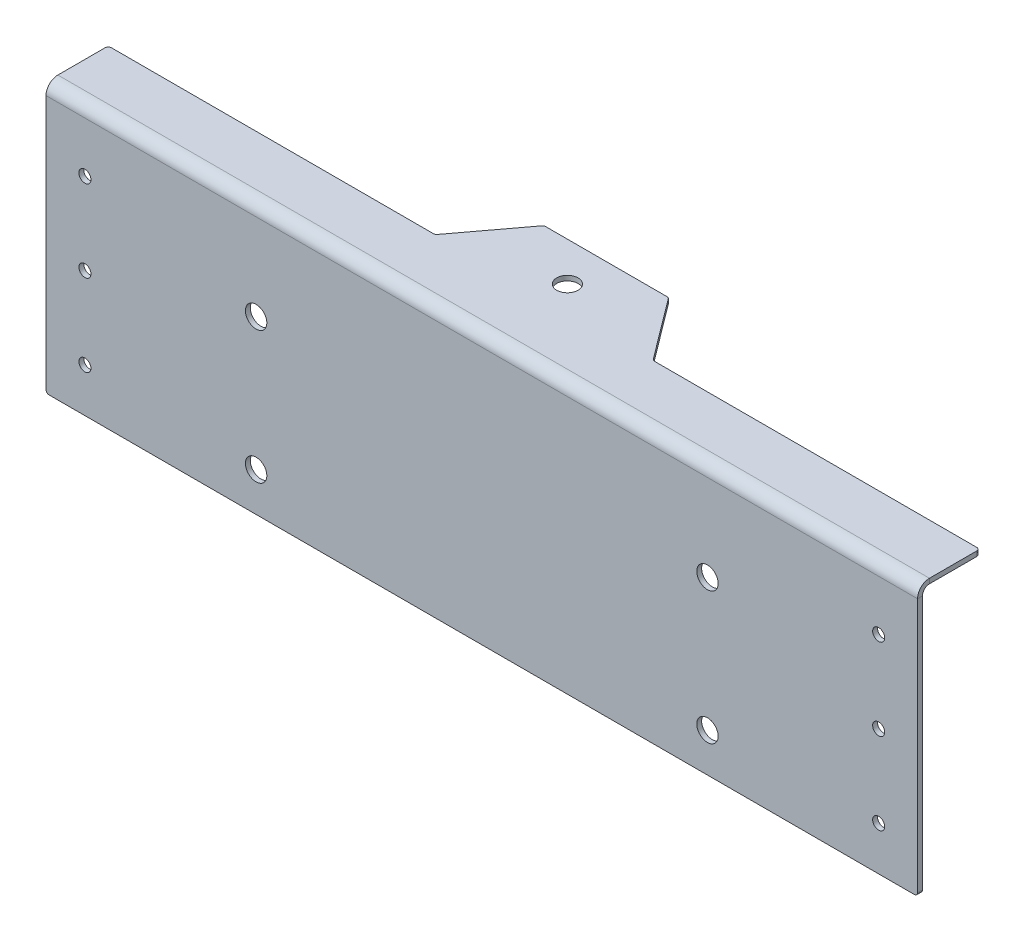
ISO-10303-21;
HEADER;
FILE_DESCRIPTION(('STEP AP214'),'2;1');
FILE_NAME('part.step','',(''),(''),'','','');
FILE_SCHEMA(('AUTOMOTIVE_DESIGN { 1 0 10303 214 1 1 1 1 }'));
ENDSEC;
DATA;
#1=APPLICATION_CONTEXT('core data for automotive mechanical design processes');
#2=APPLICATION_PROTOCOL_DEFINITION('international standard','automotive_design',2000,#1);
#3=PRODUCT_CONTEXT('',#1,'mechanical');
#4=PRODUCT('Part','Part','',(#3));
#5=PRODUCT_RELATED_PRODUCT_CATEGORY('part','',(#4));
#6=PRODUCT_DEFINITION_FORMATION('','',#4);
#7=PRODUCT_DEFINITION_CONTEXT('part definition',#1,'design');
#8=PRODUCT_DEFINITION('design','',#6,#7);
#9=PRODUCT_DEFINITION_SHAPE('','',#8);
#10=(LENGTH_UNIT() NAMED_UNIT(*) SI_UNIT(.MILLI.,.METRE.));
#11=(NAMED_UNIT(*) PLANE_ANGLE_UNIT() SI_UNIT($,.RADIAN.));
#12=(NAMED_UNIT(*) SI_UNIT($,.STERADIAN.) SOLID_ANGLE_UNIT());
#13=UNCERTAINTY_MEASURE_WITH_UNIT(LENGTH_MEASURE(1.E-05),#10,'distance_accuracy_value','');
#14=(GEOMETRIC_REPRESENTATION_CONTEXT(3) GLOBAL_UNCERTAINTY_ASSIGNED_CONTEXT((#13)) GLOBAL_UNIT_ASSIGNED_CONTEXT((#10,
#11,#12)) REPRESENTATION_CONTEXT('',''));
#15=CARTESIAN_POINT('',(0.,0.,0.));
#16=DIRECTION('',(0.,0.,1.));
#17=DIRECTION('',(1.,0.,0.));
#18=AXIS2_PLACEMENT_3D('',#15,#16,#17);
#19=CARTESIAN_POINT('',(0.,0.,-1.9939));
#20=DIRECTION('',(-1.,0.,0.));
#21=DIRECTION('',(0.,0.,1.));
#22=AXIS2_PLACEMENT_3D('',#19,#20,#21);
#23=PLANE('',#22);
#24=DIRECTION('',(0.,-1.,0.));
#25=VECTOR('',#24,1.);
#26=CARTESIAN_POINT('',(0.,0.,-1.9939));
#27=LINE('',#26,#25);
#28=CARTESIAN_POINT('',(0.,105.156,-1.99389999999998));
#29=VERTEX_POINT('',#28);
#30=CARTESIAN_POINT('',(0.,1.27,-1.9939));
#31=VERTEX_POINT('',#30);
#32=EDGE_CURVE('E334',#29,#31,#27,.T.);
#33=ORIENTED_EDGE('',*,*,#32,.T.);
#34=DIRECTION('',(0.,0.,1.));
#35=VECTOR('',#34,1.);
#36=CARTESIAN_POINT('',(0.,1.27,-1.9939));
#37=LINE('',#36,#35);
#38=CARTESIAN_POINT('',(0.,1.27,0.));
#39=VERTEX_POINT('',#38);
#40=EDGE_CURVE('E419',#31,#39,#37,.T.);
#41=ORIENTED_EDGE('',*,*,#40,.T.);
#42=DIRECTION('',(0.,-1.,0.));
#43=VECTOR('',#42,1.);
#44=CARTESIAN_POINT('',(0.,0.,0.));
#45=LINE('',#44,#43);
#46=CARTESIAN_POINT('',(0.,105.156,0.));
#47=VERTEX_POINT('',#46);
#48=EDGE_CURVE('E329',#47,#39,#45,.T.);
#49=ORIENTED_EDGE('',*,*,#48,.F.);
#50=DIRECTION('',(0.,0.,1.));
#51=VECTOR('',#50,1.);
#52=CARTESIAN_POINT('',(0.,105.156,-1.9939));
#53=LINE('',#52,#51);
#54=EDGE_CURVE('E352',#29,#47,#53,.T.);
#55=ORIENTED_EDGE('',*,*,#54,.F.);
#56=EDGE_LOOP('',(#33,#41,#49,#55));
#57=FACE_BOUND('',#56,.T.);
#58=ADVANCED_FACE('F120',(#57),#23,.T.);
#59=CARTESIAN_POINT('',(355.6,0.,-1.9939));
#60=DIRECTION('',(1.,0.,0.));
#61=DIRECTION('',(0.,0.,-1.));
#62=AXIS2_PLACEMENT_3D('',#59,#60,#61);
#63=PLANE('',#62);
#64=DIRECTION('',(0.,1.,0.));
#65=VECTOR('',#64,1.);
#66=CARTESIAN_POINT('',(355.6,0.,0.));
#67=LINE('',#66,#65);
#68=CARTESIAN_POINT('',(355.6,1.27,0.));
#69=VERTEX_POINT('',#68);
#70=CARTESIAN_POINT('',(355.6,105.156,0.));
#71=VERTEX_POINT('',#70);
#72=EDGE_CURVE('E349',#69,#71,#67,.T.);
#73=ORIENTED_EDGE('',*,*,#72,.F.);
#74=DIRECTION('',(0.,0.,1.));
#75=VECTOR('',#74,1.);
#76=CARTESIAN_POINT('',(355.6,1.27,-1.9939));
#77=LINE('',#76,#75);
#78=CARTESIAN_POINT('',(355.6,1.27,-1.9939));
#79=VERTEX_POINT('',#78);
#80=EDGE_CURVE('E143',#69,#79,#77,.F.);
#81=ORIENTED_EDGE('',*,*,#80,.T.);
#82=DIRECTION('',(0.,1.,0.));
#83=VECTOR('',#82,1.);
#84=CARTESIAN_POINT('',(355.6,0.,-1.9939));
#85=LINE('',#84,#83);
#86=CARTESIAN_POINT('',(355.6,105.156,-1.99389999999998));
#87=VERTEX_POINT('',#86);
#88=EDGE_CURVE('E339',#79,#87,#85,.T.);
#89=ORIENTED_EDGE('',*,*,#88,.T.);
#90=DIRECTION('',(0.,0.,1.));
#91=VECTOR('',#90,1.);
#92=CARTESIAN_POINT('',(355.6,105.156,-1.9939));
#93=LINE('',#92,#91);
#94=EDGE_CURVE('E343',#87,#71,#93,.T.);
#95=ORIENTED_EDGE('',*,*,#94,.T.);
#96=EDGE_LOOP('',(#73,#81,#89,#95));
#97=FACE_BOUND('',#96,.T.);
#98=ADVANCED_FACE('F552',(#97),#63,.T.);
#99=CARTESIAN_POINT('',(0.,0.,-1.9939));
#100=DIRECTION('',(0.,-1.,0.));
#101=DIRECTION('',(0.,0.,-1.));
#102=AXIS2_PLACEMENT_3D('',#99,#100,#101);
#103=PLANE('',#102);
#104=DIRECTION('',(1.,0.,0.));
#105=VECTOR('',#104,1.);
#106=CARTESIAN_POINT('',(0.,0.,-1.9939));
#107=LINE('',#106,#105);
#108=CARTESIAN_POINT('',(1.27,0.,-1.9939));
#109=VERTEX_POINT('',#108);
#110=CARTESIAN_POINT('',(354.33,0.,-1.9939));
#111=VERTEX_POINT('',#110);
#112=EDGE_CURVE('E336',#109,#111,#107,.T.);
#113=ORIENTED_EDGE('',*,*,#112,.T.);
#114=DIRECTION('',(0.,0.,1.));
#115=VECTOR('',#114,1.);
#116=CARTESIAN_POINT('',(354.33,0.,-1.9939));
#117=LINE('',#116,#115);
#118=CARTESIAN_POINT('',(354.33,0.,0.));
#119=VERTEX_POINT('',#118);
#120=EDGE_CURVE('E408',#111,#119,#117,.T.);
#121=ORIENTED_EDGE('',*,*,#120,.T.);
#122=DIRECTION('',(1.,0.,0.));
#123=VECTOR('',#122,1.);
#124=CARTESIAN_POINT('',(0.,0.,0.));
#125=LINE('',#124,#123);
#126=CARTESIAN_POINT('',(1.27,0.,0.));
#127=VERTEX_POINT('',#126);
#128=EDGE_CURVE('E346',#127,#119,#125,.T.);
#129=ORIENTED_EDGE('',*,*,#128,.F.);
#130=DIRECTION('',(0.,0.,1.));
#131=VECTOR('',#130,1.);
#132=CARTESIAN_POINT('',(1.27,0.,-1.9939));
#133=LINE('',#132,#131);
#134=EDGE_CURVE('E406',#127,#109,#133,.F.);
#135=ORIENTED_EDGE('',*,*,#134,.T.);
#136=EDGE_LOOP('',(#113,#121,#129,#135));
#137=FACE_BOUND('',#136,.T.);
#138=ADVANCED_FACE('F545',(#137),#103,.T.);
#139=CARTESIAN_POINT('',(0.,0.,-1.9939));
#140=DIRECTION('',(0.,0.,-1.));
#141=DIRECTION('',(-1.,0.,0.));
#142=AXIS2_PLACEMENT_3D('',#139,#140,#141);
#143=PLANE('',#142);
#144=CARTESIAN_POINT('',(85.725,69.86397,-1.9939));
#145=DIRECTION('',(0.,0.,-1.));
#146=DIRECTION('',(-1.,0.,0.));
#147=AXIS2_PLACEMENT_3D('',#144,#145,#146);
#148=CIRCLE('',#147,4.36879999999999);
#149=CARTESIAN_POINT('',(81.3562,69.86397,-1.9939));
#150=VERTEX_POINT('',#149);
#151=EDGE_CURVE('E509',#150,#150,#148,.T.);
#152=ORIENTED_EDGE('',*,*,#151,.F.);
#153=EDGE_LOOP('',(#152));
#154=FACE_BOUND('',#153,.T.);
#155=CARTESIAN_POINT('',(85.725,15.88897,-1.9939));
#156=DIRECTION('',(0.,0.,-1.));
#157=DIRECTION('',(-1.,0.,0.));
#158=AXIS2_PLACEMENT_3D('',#155,#156,#157);
#159=CIRCLE('',#158,4.36879999999999);
#160=CARTESIAN_POINT('',(81.3562,15.88897,-1.9939));
#161=VERTEX_POINT('',#160);
#162=EDGE_CURVE('E503',#161,#161,#159,.T.);
#163=ORIENTED_EDGE('',*,*,#162,.F.);
#164=EDGE_LOOP('',(#163));
#165=FACE_BOUND('',#164,.T.);
#166=CARTESIAN_POINT('',(269.875,15.88897,-1.9939));
#167=DIRECTION('',(0.,0.,-1.));
#168=DIRECTION('',(-1.,0.,0.));
#169=AXIS2_PLACEMENT_3D('',#166,#167,#168);
#170=CIRCLE('',#169,4.36880000000001);
#171=CARTESIAN_POINT('',(265.5062,15.88897,-1.9939));
#172=VERTEX_POINT('',#171);
#173=EDGE_CURVE('E497',#172,#172,#170,.T.);
#174=ORIENTED_EDGE('',*,*,#173,.F.);
#175=EDGE_LOOP('',(#174));
#176=FACE_BOUND('',#175,.T.);
#177=CARTESIAN_POINT('',(269.875,69.86397,-1.9939));
#178=DIRECTION('',(0.,0.,-1.));
#179=DIRECTION('',(-1.,0.,0.));
#180=AXIS2_PLACEMENT_3D('',#177,#178,#179);
#181=CIRCLE('',#180,4.36880000000001);
#182=CARTESIAN_POINT('',(265.5062,69.86397,-1.9939));
#183=VERTEX_POINT('',#182);
#184=EDGE_CURVE('E491',#183,#183,#181,.T.);
#185=ORIENTED_EDGE('',*,*,#184,.F.);
#186=EDGE_LOOP('',(#185));
#187=FACE_BOUND('',#186,.T.);
#188=CARTESIAN_POINT('',(15.875,84.59597,-1.9939));
#189=DIRECTION('',(0.,0.,-1.));
#190=DIRECTION('',(-1.,0.,0.));
#191=AXIS2_PLACEMENT_3D('',#188,#189,#190);
#192=CIRCLE('',#191,2.45744999999999);
#193=CARTESIAN_POINT('',(13.41755,84.59597,-1.9939));
#194=VERTEX_POINT('',#193);
#195=EDGE_CURVE('E484',#194,#194,#192,.T.);
#196=ORIENTED_EDGE('',*,*,#195,.F.);
#197=EDGE_LOOP('',(#196));
#198=FACE_BOUND('',#197,.T.);
#199=CARTESIAN_POINT('',(15.875,17.92097,-1.9939));
#200=DIRECTION('',(0.,0.,-1.));
#201=DIRECTION('',(-1.,0.,0.));
#202=AXIS2_PLACEMENT_3D('',#199,#200,#201);
#203=CIRCLE('',#202,2.45744999999999);
#204=CARTESIAN_POINT('',(13.41755,17.92097,-1.9939));
#205=VERTEX_POINT('',#204);
#206=EDGE_CURVE('E478',#205,#205,#203,.T.);
#207=ORIENTED_EDGE('',*,*,#206,.F.);
#208=EDGE_LOOP('',(#207));
#209=FACE_BOUND('',#208,.T.);
#210=CARTESIAN_POINT('',(339.725,17.92097,-1.9939));
#211=DIRECTION('',(0.,0.,-1.));
#212=DIRECTION('',(-1.,0.,0.));
#213=AXIS2_PLACEMENT_3D('',#210,#211,#212);
#214=CIRCLE('',#213,2.45744999999997);
#215=CARTESIAN_POINT('',(337.26755,17.92097,-1.9939));
#216=VERTEX_POINT('',#215);
#217=EDGE_CURVE('E472',#216,#216,#214,.T.);
#218=ORIENTED_EDGE('',*,*,#217,.F.);
#219=EDGE_LOOP('',(#218));
#220=FACE_BOUND('',#219,.T.);
#221=CARTESIAN_POINT('',(339.725,84.59597,-1.9939));
#222=DIRECTION('',(0.,0.,-1.));
#223=DIRECTION('',(-1.,0.,0.));
#224=AXIS2_PLACEMENT_3D('',#221,#222,#223);
#225=CIRCLE('',#224,2.45744999999997);
#226=CARTESIAN_POINT('',(337.26755,84.59597,-1.9939));
#227=VERTEX_POINT('',#226);
#228=EDGE_CURVE('E466',#227,#227,#225,.T.);
#229=ORIENTED_EDGE('',*,*,#228,.F.);
#230=EDGE_LOOP('',(#229));
#231=FACE_BOUND('',#230,.T.);
#232=CARTESIAN_POINT('',(15.875,51.25847,-1.9939));
#233=DIRECTION('',(0.,0.,-1.));
#234=DIRECTION('',(-1.,0.,0.));
#235=AXIS2_PLACEMENT_3D('',#232,#233,#234);
#236=CIRCLE('',#235,2.45744999999999);
#237=CARTESIAN_POINT('',(13.41755,51.25847,-1.9939));
#238=VERTEX_POINT('',#237);
#239=EDGE_CURVE('E460',#238,#238,#236,.T.);
#240=ORIENTED_EDGE('',*,*,#239,.F.);
#241=EDGE_LOOP('',(#240));
#242=FACE_BOUND('',#241,.T.);
#243=CARTESIAN_POINT('',(339.725,51.25847,-1.9939));
#244=DIRECTION('',(0.,0.,-1.));
#245=DIRECTION('',(-1.,0.,0.));
#246=AXIS2_PLACEMENT_3D('',#243,#244,#245);
#247=CIRCLE('',#246,2.45744999999997);
#248=CARTESIAN_POINT('',(337.26755,51.25847,-1.9939));
#249=VERTEX_POINT('',#248);
#250=EDGE_CURVE('E328',#249,#249,#247,.T.);
#251=ORIENTED_EDGE('',*,*,#250,.F.);
#252=EDGE_LOOP('',(#251));
#253=FACE_BOUND('',#252,.T.);
#254=ORIENTED_EDGE('',*,*,#88,.F.);
#255=CARTESIAN_POINT('',(354.33,1.27,-1.9939));
#256=DIRECTION('',(0.,0.,-1.));
#257=DIRECTION('',(-1.,0.,0.));
#258=AXIS2_PLACEMENT_3D('',#255,#256,#257);
#259=CIRCLE('',#258,1.27);
#260=EDGE_CURVE('E417',#79,#111,#259,.T.);
#261=ORIENTED_EDGE('',*,*,#260,.T.);
#262=ORIENTED_EDGE('',*,*,#112,.F.);
#263=CARTESIAN_POINT('',(1.27,1.27,-1.9939));
#264=DIRECTION('',(0.,0.,-1.));
#265=DIRECTION('',(-1.,0.,0.));
#266=AXIS2_PLACEMENT_3D('',#263,#264,#265);
#267=CIRCLE('',#266,1.27);
#268=EDGE_CURVE('E135',#109,#31,#267,.T.);
#269=ORIENTED_EDGE('',*,*,#268,.T.);
#270=ORIENTED_EDGE('',*,*,#32,.F.);
#271=DIRECTION('',(-1.,0.,0.));
#272=VECTOR('',#271,1.);
#273=CARTESIAN_POINT('',(0.,105.156,-1.9939));
#274=LINE('',#273,#272);
#275=EDGE_CURVE('E341',#87,#29,#274,.T.);
#276=ORIENTED_EDGE('',*,*,#275,.F.);
#277=EDGE_LOOP('',(#254,#261,#262,#269,#270,#276));
#278=FACE_BOUND('',#277,.T.);
#279=ADVANCED_FACE('F522',(#154,#165,#176,#187,#198,#209,#220,#231,#242,#253,#278),#143,.T.);
#280=CARTESIAN_POINT('',(0.,0.,0.));
#281=DIRECTION('',(0.,0.,-1.));
#282=DIRECTION('',(-1.,0.,0.));
#283=AXIS2_PLACEMENT_3D('',#280,#281,#282);
#284=PLANE('',#283);
#285=CARTESIAN_POINT('',(85.725,69.86397,0.));
#286=DIRECTION('',(0.,0.,1.));
#287=DIRECTION('',(1.,0.,0.));
#288=AXIS2_PLACEMENT_3D('',#285,#286,#287);
#289=CIRCLE('',#288,4.36879999999999);
#290=CARTESIAN_POINT('',(90.0938,69.86397,0.));
#291=VERTEX_POINT('',#290);
#292=EDGE_CURVE('E512',#291,#291,#289,.T.);
#293=ORIENTED_EDGE('',*,*,#292,.F.);
#294=EDGE_LOOP('',(#293));
#295=FACE_BOUND('',#294,.T.);
#296=CARTESIAN_POINT('',(85.725,15.88897,0.));
#297=DIRECTION('',(0.,0.,1.));
#298=DIRECTION('',(1.,0.,0.));
#299=AXIS2_PLACEMENT_3D('',#296,#297,#298);
#300=CIRCLE('',#299,4.36879999999999);
#301=CARTESIAN_POINT('',(90.0938,15.88897,0.));
#302=VERTEX_POINT('',#301);
#303=EDGE_CURVE('E506',#302,#302,#300,.T.);
#304=ORIENTED_EDGE('',*,*,#303,.F.);
#305=EDGE_LOOP('',(#304));
#306=FACE_BOUND('',#305,.T.);
#307=CARTESIAN_POINT('',(269.875,15.88897,0.));
#308=DIRECTION('',(0.,0.,1.));
#309=DIRECTION('',(1.,0.,0.));
#310=AXIS2_PLACEMENT_3D('',#307,#308,#309);
#311=CIRCLE('',#310,4.36880000000001);
#312=CARTESIAN_POINT('',(274.2438,15.88897,0.));
#313=VERTEX_POINT('',#312);
#314=EDGE_CURVE('E500',#313,#313,#311,.T.);
#315=ORIENTED_EDGE('',*,*,#314,.F.);
#316=EDGE_LOOP('',(#315));
#317=FACE_BOUND('',#316,.T.);
#318=CARTESIAN_POINT('',(269.875,69.86397,0.));
#319=DIRECTION('',(0.,0.,1.));
#320=DIRECTION('',(1.,0.,0.));
#321=AXIS2_PLACEMENT_3D('',#318,#319,#320);
#322=CIRCLE('',#321,4.36880000000001);
#323=CARTESIAN_POINT('',(274.2438,69.86397,0.));
#324=VERTEX_POINT('',#323);
#325=EDGE_CURVE('E494',#324,#324,#322,.T.);
#326=ORIENTED_EDGE('',*,*,#325,.F.);
#327=EDGE_LOOP('',(#326));
#328=FACE_BOUND('',#327,.T.);
#329=CARTESIAN_POINT('',(15.875,84.59597,0.));
#330=DIRECTION('',(0.,0.,1.));
#331=DIRECTION('',(1.,0.,0.));
#332=AXIS2_PLACEMENT_3D('',#329,#330,#331);
#333=CIRCLE('',#332,2.45744999999999);
#334=CARTESIAN_POINT('',(18.33245,84.59597,0.));
#335=VERTEX_POINT('',#334);
#336=EDGE_CURVE('E360',#335,#335,#333,.T.);
#337=ORIENTED_EDGE('',*,*,#336,.F.);
#338=EDGE_LOOP('',(#337));
#339=FACE_BOUND('',#338,.T.);
#340=CARTESIAN_POINT('',(15.875,17.92097,0.));
#341=DIRECTION('',(0.,0.,1.));
#342=DIRECTION('',(1.,0.,0.));
#343=AXIS2_PLACEMENT_3D('',#340,#341,#342);
#344=CIRCLE('',#343,2.45744999999999);
#345=CARTESIAN_POINT('',(18.33245,17.92097,0.));
#346=VERTEX_POINT('',#345);
#347=EDGE_CURVE('E481',#346,#346,#344,.T.);
#348=ORIENTED_EDGE('',*,*,#347,.F.);
#349=EDGE_LOOP('',(#348));
#350=FACE_BOUND('',#349,.T.);
#351=CARTESIAN_POINT('',(339.725,17.92097,0.));
#352=DIRECTION('',(0.,0.,1.));
#353=DIRECTION('',(1.,0.,0.));
#354=AXIS2_PLACEMENT_3D('',#351,#352,#353);
#355=CIRCLE('',#354,2.45744999999997);
#356=CARTESIAN_POINT('',(342.18245,17.92097,0.));
#357=VERTEX_POINT('',#356);
#358=EDGE_CURVE('E475',#357,#357,#355,.T.);
#359=ORIENTED_EDGE('',*,*,#358,.F.);
#360=EDGE_LOOP('',(#359));
#361=FACE_BOUND('',#360,.T.);
#362=CARTESIAN_POINT('',(339.725,84.59597,0.));
#363=DIRECTION('',(0.,0.,1.));
#364=DIRECTION('',(1.,0.,0.));
#365=AXIS2_PLACEMENT_3D('',#362,#363,#364);
#366=CIRCLE('',#365,2.45744999999997);
#367=CARTESIAN_POINT('',(342.18245,84.59597,0.));
#368=VERTEX_POINT('',#367);
#369=EDGE_CURVE('E469',#368,#368,#366,.T.);
#370=ORIENTED_EDGE('',*,*,#369,.F.);
#371=EDGE_LOOP('',(#370));
#372=FACE_BOUND('',#371,.T.);
#373=CARTESIAN_POINT('',(15.875,51.25847,0.));
#374=DIRECTION('',(0.,0.,1.));
#375=DIRECTION('',(1.,0.,0.));
#376=AXIS2_PLACEMENT_3D('',#373,#374,#375);
#377=CIRCLE('',#376,2.45744999999999);
#378=CARTESIAN_POINT('',(18.33245,51.25847,0.));
#379=VERTEX_POINT('',#378);
#380=EDGE_CURVE('E463',#379,#379,#377,.T.);
#381=ORIENTED_EDGE('',*,*,#380,.F.);
#382=EDGE_LOOP('',(#381));
#383=FACE_BOUND('',#382,.T.);
#384=CARTESIAN_POINT('',(339.725,51.25847,0.));
#385=DIRECTION('',(0.,0.,1.));
#386=DIRECTION('',(1.,0.,0.));
#387=AXIS2_PLACEMENT_3D('',#384,#385,#386);
#388=CIRCLE('',#387,2.45744999999997);
#389=CARTESIAN_POINT('',(342.18245,51.25847,0.));
#390=VERTEX_POINT('',#389);
#391=EDGE_CURVE('E457',#390,#390,#388,.T.);
#392=ORIENTED_EDGE('',*,*,#391,.F.);
#393=EDGE_LOOP('',(#392));
#394=FACE_BOUND('',#393,.T.);
#395=ORIENTED_EDGE('',*,*,#128,.T.);
#396=CARTESIAN_POINT('',(354.33,1.27,0.));
#397=DIRECTION('',(0.,0.,-1.));
#398=DIRECTION('',(-1.,0.,0.));
#399=AXIS2_PLACEMENT_3D('',#396,#397,#398);
#400=CIRCLE('',#399,1.27);
#401=EDGE_CURVE('E413',#119,#69,#400,.F.);
#402=ORIENTED_EDGE('',*,*,#401,.T.);
#403=ORIENTED_EDGE('',*,*,#72,.T.);
#404=DIRECTION('',(-1.,0.,0.));
#405=VECTOR('',#404,1.);
#406=CARTESIAN_POINT('',(0.,105.156,0.));
#407=LINE('',#406,#405);
#408=EDGE_CURVE('E267',#71,#47,#407,.T.);
#409=ORIENTED_EDGE('',*,*,#408,.T.);
#410=ORIENTED_EDGE('',*,*,#48,.T.);
#411=CARTESIAN_POINT('',(1.27,1.27,0.));
#412=DIRECTION('',(0.,0.,-1.));
#413=DIRECTION('',(-1.,0.,0.));
#414=AXIS2_PLACEMENT_3D('',#411,#412,#413);
#415=CIRCLE('',#414,1.27);
#416=EDGE_CURVE('E411',#39,#127,#415,.F.);
#417=ORIENTED_EDGE('',*,*,#416,.T.);
#418=EDGE_LOOP('',(#395,#402,#403,#409,#410,#417));
#419=FACE_BOUND('',#418,.T.);
#420=ADVANCED_FACE('F518',(#295,#306,#317,#328,#339,#350,#361,#372,#383,#394,#419),#284,.F.);
#421=CARTESIAN_POINT('',(0.,105.156,-4.83996999999999));
#422=DIRECTION('',(-1.,0.,0.));
#423=DIRECTION('',(0.,0.,1.));
#424=AXIS2_PLACEMENT_3D('',#421,#422,#423);
#425=PLANE('',#424);
#426=DIRECTION('',(0.,-1.,0.));
#427=VECTOR('',#426,1.);
#428=CARTESIAN_POINT('',(0.,109.99597,-4.83996999999998));
#429=LINE('',#428,#427);
#430=CARTESIAN_POINT('',(0.,108.00207,-4.83996999999998));
#431=VERTEX_POINT('',#430);
#432=CARTESIAN_POINT('',(0.,109.99597,-4.83996999999997));
#433=VERTEX_POINT('',#432);
#434=EDGE_CURVE('E325',#431,#433,#429,.F.);
#435=ORIENTED_EDGE('',*,*,#434,.F.);
#436=CARTESIAN_POINT('',(0.,105.156,-4.83996999999999));
#437=DIRECTION('',(1.,0.,0.));
#438=DIRECTION('',(0.,0.,-1.));
#439=AXIS2_PLACEMENT_3D('',#436,#437,#438);
#440=CIRCLE('',#439,2.84607000000001);
#441=EDGE_CURVE('E272',#29,#431,#440,.F.);
#442=ORIENTED_EDGE('',*,*,#441,.F.);
#443=ORIENTED_EDGE('',*,*,#54,.T.);
#444=CARTESIAN_POINT('',(0.,105.156,-4.83996999999999));
#445=DIRECTION('',(1.,0.,0.));
#446=DIRECTION('',(0.,0.,-1.));
#447=AXIS2_PLACEMENT_3D('',#444,#445,#446);
#448=CIRCLE('',#447,4.83997000000001);
#449=EDGE_CURVE('E271',#47,#433,#448,.F.);
#450=ORIENTED_EDGE('',*,*,#449,.T.);
#451=EDGE_LOOP('',(#435,#442,#443,#450));
#452=FACE_BOUND('',#451,.T.);
#453=ADVANCED_FACE('F521',(#452),#425,.T.);
#454=CARTESIAN_POINT('',(355.6,105.156,-4.83996999999999));
#455=DIRECTION('',(-1.,0.,0.));
#456=DIRECTION('',(0.,0.,1.));
#457=AXIS2_PLACEMENT_3D('',#454,#455,#456);
#458=PLANE('',#457);
#459=CARTESIAN_POINT('',(355.6,105.156,-4.83996999999999));
#460=DIRECTION('',(1.,0.,0.));
#461=DIRECTION('',(0.,0.,-1.));
#462=AXIS2_PLACEMENT_3D('',#459,#460,#461);
#463=CIRCLE('',#462,2.84607000000001);
#464=CARTESIAN_POINT('',(355.6,108.00207,-4.83996999999998));
#465=VERTEX_POINT('',#464);
#466=EDGE_CURVE('E279',#465,#87,#463,.T.);
#467=ORIENTED_EDGE('',*,*,#466,.F.);
#468=DIRECTION('',(0.,-1.,0.));
#469=VECTOR('',#468,1.);
#470=CARTESIAN_POINT('',(355.6,108.00207,-4.83996999999997));
#471=LINE('',#470,#469);
#472=CARTESIAN_POINT('',(355.6,109.99597,-4.83996999999996));
#473=VERTEX_POINT('',#472);
#474=EDGE_CURVE('E276',#465,#473,#471,.F.);
#475=ORIENTED_EDGE('',*,*,#474,.T.);
#476=CARTESIAN_POINT('',(355.6,105.156,-4.83996999999999));
#477=DIRECTION('',(1.,0.,0.));
#478=DIRECTION('',(0.,0.,-1.));
#479=AXIS2_PLACEMENT_3D('',#476,#477,#478);
#480=CIRCLE('',#479,4.83997000000001);
#481=EDGE_CURVE('E260',#473,#71,#480,.T.);
#482=ORIENTED_EDGE('',*,*,#481,.T.);
#483=ORIENTED_EDGE('',*,*,#94,.F.);
#484=EDGE_LOOP('',(#467,#475,#482,#483));
#485=FACE_BOUND('',#484,.T.);
#486=ADVANCED_FACE('F277',(#485),#458,.F.);
#487=CARTESIAN_POINT('',(355.6,105.156,-4.83996999999999));
#488=DIRECTION('',(1.,0.,0.));
#489=DIRECTION('',(0.,1.,0.));
#490=AXIS2_PLACEMENT_3D('',#487,#488,#489);
#491=CYLINDRICAL_SURFACE('',#490,4.83997000000001);
#492=ORIENTED_EDGE('',*,*,#408,.F.);
#493=ORIENTED_EDGE('',*,*,#481,.F.);
#494=DIRECTION('',(1.,0.,0.));
#495=VECTOR('',#494,1.);
#496=CARTESIAN_POINT('',(0.,109.99597,-4.83996999999998));
#497=LINE('',#496,#495);
#498=EDGE_CURVE('E264',#473,#433,#497,.F.);
#499=ORIENTED_EDGE('',*,*,#498,.T.);
#500=ORIENTED_EDGE('',*,*,#449,.F.);
#501=EDGE_LOOP('',(#492,#493,#499,#500));
#502=FACE_BOUND('',#501,.T.);
#503=ADVANCED_FACE('F262',(#502),#491,.T.);
#504=CARTESIAN_POINT('',(355.6,105.156,-4.83996999999999));
#505=DIRECTION('',(1.,0.,0.));
#506=DIRECTION('',(0.,1.,0.));
#507=AXIS2_PLACEMENT_3D('',#504,#505,#506);
#508=CYLINDRICAL_SURFACE('',#507,2.84607000000001);
#509=ORIENTED_EDGE('',*,*,#275,.T.);
#510=ORIENTED_EDGE('',*,*,#441,.T.);
#511=DIRECTION('',(1.,0.,0.));
#512=VECTOR('',#511,1.);
#513=CARTESIAN_POINT('',(0.,108.00207,-4.83996999999999));
#514=LINE('',#513,#512);
#515=EDGE_CURVE('E284',#431,#465,#514,.T.);
#516=ORIENTED_EDGE('',*,*,#515,.T.);
#517=ORIENTED_EDGE('',*,*,#466,.T.);
#518=EDGE_LOOP('',(#509,#510,#516,#517));
#519=FACE_BOUND('',#518,.T.);
#520=ADVANCED_FACE('F558',(#519),#508,.F.);
#521=CARTESIAN_POINT('',(355.6,109.99597,-25.4));
#522=DIRECTION('',(-1.,0.,0.));
#523=DIRECTION('',(0.,0.,1.));
#524=AXIS2_PLACEMENT_3D('',#521,#522,#523);
#525=PLANE('',#524);
#526=DIRECTION('',(0.,0.,1.));
#527=VECTOR('',#526,1.);
#528=CARTESIAN_POINT('',(355.6,108.00207,-25.4));
#529=LINE('',#528,#527);
#530=CARTESIAN_POINT('',(355.6,108.00207,-24.13));
#531=VERTEX_POINT('',#530);
#532=EDGE_CURVE('E294',#465,#531,#529,.F.);
#533=ORIENTED_EDGE('',*,*,#532,.T.);
#534=DIRECTION('',(0.,-1.,0.));
#535=VECTOR('',#534,1.);
#536=CARTESIAN_POINT('',(355.6,109.99597,-24.13));
#537=LINE('',#536,#535);
#538=CARTESIAN_POINT('',(355.6,109.99597,-24.13));
#539=VERTEX_POINT('',#538);
#540=EDGE_CURVE('E298',#531,#539,#537,.F.);
#541=ORIENTED_EDGE('',*,*,#540,.T.);
#542=DIRECTION('',(0.,0.,-1.));
#543=VECTOR('',#542,1.);
#544=CARTESIAN_POINT('',(355.6,109.99597,3.81052005548856E-13));
#545=LINE('',#544,#543);
#546=EDGE_CURVE('E290',#473,#539,#545,.T.);
#547=ORIENTED_EDGE('',*,*,#546,.F.);
#548=ORIENTED_EDGE('',*,*,#474,.F.);
#549=EDGE_LOOP('',(#533,#541,#547,#548));
#550=FACE_BOUND('',#549,.T.);
#551=ADVANCED_FACE('F296',(#550),#525,.F.);
#552=CARTESIAN_POINT('',(0.,109.99597,-1.99389999999999));
#553=DIRECTION('',(1.,0.,0.));
#554=DIRECTION('',(0.,0.,-1.));
#555=AXIS2_PLACEMENT_3D('',#552,#553,#554);
#556=PLANE('',#555);
#557=DIRECTION('',(0.,0.,1.));
#558=VECTOR('',#557,1.);
#559=CARTESIAN_POINT('',(0.,109.99597,3.81052005548856E-13));
#560=LINE('',#559,#558);
#561=CARTESIAN_POINT('',(0.,109.99597,-24.13));
#562=VERTEX_POINT('',#561);
#563=EDGE_CURVE('E293',#562,#433,#560,.T.);
#564=ORIENTED_EDGE('',*,*,#563,.F.);
#565=DIRECTION('',(0.,-1.,0.));
#566=VECTOR('',#565,1.);
#567=CARTESIAN_POINT('',(0.,109.99597,-24.13));
#568=LINE('',#567,#566);
#569=CARTESIAN_POINT('',(0.,108.00207,-24.13));
#570=VERTEX_POINT('',#569);
#571=EDGE_CURVE('E355',#562,#570,#568,.T.);
#572=ORIENTED_EDGE('',*,*,#571,.T.);
#573=DIRECTION('',(0.,0.,-1.));
#574=VECTOR('',#573,1.);
#575=CARTESIAN_POINT('',(0.,108.00207,-1.9939));
#576=LINE('',#575,#574);
#577=EDGE_CURVE('E300',#570,#431,#576,.F.);
#578=ORIENTED_EDGE('',*,*,#577,.T.);
#579=ORIENTED_EDGE('',*,*,#434,.T.);
#580=EDGE_LOOP('',(#564,#572,#578,#579));
#581=FACE_BOUND('',#580,.T.);
#582=ADVANCED_FACE('F618',(#581),#556,.F.);
#583=CARTESIAN_POINT('',(0.,109.99597,3.81052005548856E-13));
#584=DIRECTION('',(0.,-1.,0.));
#585=DIRECTION('',(0.,0.,-1.));
#586=AXIS2_PLACEMENT_3D('',#583,#584,#585);
#587=PLANE('',#586);
#588=CARTESIAN_POINT('',(177.8,109.99597,-34.9249999999999));
#589=DIRECTION('',(0.,1.,0.));
#590=DIRECTION('',(0.,0.,1.));
#591=AXIS2_PLACEMENT_3D('',#588,#589,#590);
#592=CIRCLE('',#591,4.36879999999998);
#593=CARTESIAN_POINT('',(177.8,109.99597,-30.5561999999999));
#594=VERTEX_POINT('',#593);
#595=EDGE_CURVE('E361',#594,#594,#592,.T.);
#596=ORIENTED_EDGE('',*,*,#595,.F.);
#597=EDGE_LOOP('',(#596));
#598=FACE_BOUND('',#597,.T.);
#599=DIRECTION('',(-1.,0.,0.));
#600=VECTOR('',#599,1.);
#601=CARTESIAN_POINT('',(0.,109.99597,-25.4));
#602=LINE('',#601,#600);
#603=CARTESIAN_POINT('',(132.715,109.99597,-25.4));
#604=VERTEX_POINT('',#603);
#605=CARTESIAN_POINT('',(1.27,109.99597,-25.4));
#606=VERTEX_POINT('',#605);
#607=EDGE_CURVE('E452',#604,#606,#602,.T.);
#608=ORIENTED_EDGE('',*,*,#607,.T.);
#609=CARTESIAN_POINT('',(1.27,109.99597,-24.13));
#610=DIRECTION('',(0.,-1.,0.));
#611=DIRECTION('',(0.,0.,-1.));
#612=AXIS2_PLACEMENT_3D('',#609,#610,#611);
#613=CIRCLE('',#612,1.27);
#614=EDGE_CURVE('E383',#606,#562,#613,.F.);
#615=ORIENTED_EDGE('',*,*,#614,.T.);
#616=ORIENTED_EDGE('',*,*,#563,.T.);
#617=ORIENTED_EDGE('',*,*,#498,.F.);
#618=ORIENTED_EDGE('',*,*,#546,.T.);
#619=CARTESIAN_POINT('',(354.33,109.99597,-24.13));
#620=DIRECTION('',(0.,-1.,0.));
#621=DIRECTION('',(0.,0.,-1.));
#622=AXIS2_PLACEMENT_3D('',#619,#620,#621);
#623=CIRCLE('',#622,1.27);
#624=CARTESIAN_POINT('',(354.33,109.99597,-25.4));
#625=VERTEX_POINT('',#624);
#626=EDGE_CURVE('E377',#539,#625,#623,.F.);
#627=ORIENTED_EDGE('',*,*,#626,.T.);
#628=DIRECTION('',(-1.,0.,0.));
#629=VECTOR('',#628,1.);
#630=CARTESIAN_POINT('',(0.,109.99597,-25.4));
#631=LINE('',#630,#629);
#632=CARTESIAN_POINT('',(222.885,109.99597,-25.4));
#633=VERTEX_POINT('',#632);
#634=EDGE_CURVE('E299',#625,#633,#631,.T.);
#635=ORIENTED_EDGE('',*,*,#634,.T.);
#636=CARTESIAN_POINT('',(222.885,109.99597,-26.67));
#637=DIRECTION('',(0.,-1.,0.));
#638=DIRECTION('',(0.,0.,-1.));
#639=AXIS2_PLACEMENT_3D('',#636,#637,#638);
#640=CIRCLE('',#639,1.27);
#641=CARTESIAN_POINT('',(221.869,109.99597,-25.908));
#642=VERTEX_POINT('',#641);
#643=EDGE_CURVE('E13',#633,#642,#640,.T.);
#644=ORIENTED_EDGE('',*,*,#643,.T.);
#645=DIRECTION('',(-0.6,0.,-0.8));
#646=VECTOR('',#645,1.);
#647=CARTESIAN_POINT('',(154.432,109.99597,-115.824));
#648=LINE('',#647,#646);
#649=CARTESIAN_POINT('',(203.581,109.99597,-50.292));
#650=VERTEX_POINT('',#649);
#651=EDGE_CURVE('E303',#642,#650,#648,.T.);
#652=ORIENTED_EDGE('',*,*,#651,.T.);
#653=CARTESIAN_POINT('',(202.565,109.99597,-49.53));
#654=DIRECTION('',(0.,-1.,0.));
#655=DIRECTION('',(0.,0.,-1.));
#656=AXIS2_PLACEMENT_3D('',#653,#654,#655);
#657=CIRCLE('',#656,1.27);
#658=CARTESIAN_POINT('',(202.565,109.99597,-50.8));
#659=VERTEX_POINT('',#658);
#660=EDGE_CURVE('E379',#650,#659,#657,.F.);
#661=ORIENTED_EDGE('',*,*,#660,.T.);
#662=DIRECTION('',(-1.,0.,0.));
#663=VECTOR('',#662,1.);
#664=CARTESIAN_POINT('',(0.,109.99597,-50.8));
#665=LINE('',#664,#663);
#666=CARTESIAN_POINT('',(153.035,109.99597,-50.8));
#667=VERTEX_POINT('',#666);
#668=EDGE_CURVE('E445',#659,#667,#665,.T.);
#669=ORIENTED_EDGE('',*,*,#668,.T.);
#670=CARTESIAN_POINT('',(153.035,109.99597,-49.53));
#671=DIRECTION('',(0.,-1.,0.));
#672=DIRECTION('',(0.,0.,-1.));
#673=AXIS2_PLACEMENT_3D('',#670,#671,#672);
#674=CIRCLE('',#673,1.27);
#675=CARTESIAN_POINT('',(152.019,109.99597,-50.292));
#676=VERTEX_POINT('',#675);
#677=EDGE_CURVE('E381',#667,#676,#674,.F.);
#678=ORIENTED_EDGE('',*,*,#677,.T.);
#679=DIRECTION('',(-0.6,0.,0.8));
#680=VECTOR('',#679,1.);
#681=CARTESIAN_POINT('',(73.1519999999998,109.99597,54.8640000000002));
#682=LINE('',#681,#680);
#683=CARTESIAN_POINT('',(133.731,109.99597,-25.908));
#684=VERTEX_POINT('',#683);
#685=EDGE_CURVE('E447',#676,#684,#682,.T.);
#686=ORIENTED_EDGE('',*,*,#685,.T.);
#687=CARTESIAN_POINT('',(132.715,109.99597,-26.67));
#688=DIRECTION('',(0.,-1.,0.));
#689=DIRECTION('',(0.,0.,-1.));
#690=AXIS2_PLACEMENT_3D('',#687,#688,#689);
#691=CIRCLE('',#690,1.27);
#692=EDGE_CURVE('E424',#684,#604,#691,.T.);
#693=ORIENTED_EDGE('',*,*,#692,.T.);
#694=EDGE_LOOP('',(#608,#615,#616,#617,#618,#627,#635,#644,#652,#661,#669,#678,#686,#693));
#695=FACE_BOUND('',#694,.T.);
#696=ADVANCED_FACE('F289',(#598,#695),#587,.F.);
#697=CARTESIAN_POINT('',(0.,108.00207,3.74090340907337E-13));
#698=DIRECTION('',(0.,-1.,0.));
#699=DIRECTION('',(0.,0.,-1.));
#700=AXIS2_PLACEMENT_3D('',#697,#698,#699);
#701=PLANE('',#700);
#702=CARTESIAN_POINT('',(177.8,108.00207,-34.9249999999999));
#703=DIRECTION('',(0.,-1.,0.));
#704=DIRECTION('',(0.,0.,-1.));
#705=AXIS2_PLACEMENT_3D('',#702,#703,#704);
#706=CIRCLE('',#705,4.36879999999998);
#707=CARTESIAN_POINT('',(177.8,108.00207,-39.2937999999999));
#708=VERTEX_POINT('',#707);
#709=EDGE_CURVE('E357',#708,#708,#706,.T.);
#710=ORIENTED_EDGE('',*,*,#709,.F.);
#711=EDGE_LOOP('',(#710));
#712=FACE_BOUND('',#711,.T.);
#713=ORIENTED_EDGE('',*,*,#577,.F.);
#714=CARTESIAN_POINT('',(1.27,108.00207,-24.13));
#715=DIRECTION('',(0.,-1.,0.));
#716=DIRECTION('',(0.,0.,-1.));
#717=AXIS2_PLACEMENT_3D('',#714,#715,#716);
#718=CIRCLE('',#717,1.27);
#719=CARTESIAN_POINT('',(1.27,108.00207,-25.4));
#720=VERTEX_POINT('',#719);
#721=EDGE_CURVE('E370',#570,#720,#718,.T.);
#722=ORIENTED_EDGE('',*,*,#721,.T.);
#723=DIRECTION('',(1.,0.,0.));
#724=VECTOR('',#723,1.);
#725=CARTESIAN_POINT('',(0.,108.00207,-25.4));
#726=LINE('',#725,#724);
#727=CARTESIAN_POINT('',(132.715,108.00207,-25.4));
#728=VERTEX_POINT('',#727);
#729=EDGE_CURVE('E305',#728,#720,#726,.F.);
#730=ORIENTED_EDGE('',*,*,#729,.F.);
#731=CARTESIAN_POINT('',(132.715,108.00207,-26.67));
#732=DIRECTION('',(0.,-1.,0.));
#733=DIRECTION('',(0.,0.,-1.));
#734=AXIS2_PLACEMENT_3D('',#731,#732,#733);
#735=CIRCLE('',#734,1.27);
#736=CARTESIAN_POINT('',(133.731,108.00207,-25.908));
#737=VERTEX_POINT('',#736);
#738=EDGE_CURVE('E422',#728,#737,#735,.F.);
#739=ORIENTED_EDGE('',*,*,#738,.T.);
#740=DIRECTION('',(0.6,0.,-0.8));
#741=VECTOR('',#740,1.);
#742=CARTESIAN_POINT('',(133.35,108.00207,-25.4));
#743=LINE('',#742,#741);
#744=CARTESIAN_POINT('',(152.019,108.00207,-50.292));
#745=VERTEX_POINT('',#744);
#746=EDGE_CURVE('E311',#745,#737,#743,.F.);
#747=ORIENTED_EDGE('',*,*,#746,.F.);
#748=CARTESIAN_POINT('',(153.035,108.00207,-49.53));
#749=DIRECTION('',(0.,-1.,0.));
#750=DIRECTION('',(0.,0.,-1.));
#751=AXIS2_PLACEMENT_3D('',#748,#749,#750);
#752=CIRCLE('',#751,1.27);
#753=CARTESIAN_POINT('',(153.035,108.00207,-50.8));
#754=VERTEX_POINT('',#753);
#755=EDGE_CURVE('E368',#745,#754,#752,.T.);
#756=ORIENTED_EDGE('',*,*,#755,.T.);
#757=DIRECTION('',(1.,0.,0.));
#758=VECTOR('',#757,1.);
#759=CARTESIAN_POINT('',(152.4,108.00207,-50.8));
#760=LINE('',#759,#758);
#761=CARTESIAN_POINT('',(202.565,108.00207,-50.8));
#762=VERTEX_POINT('',#761);
#763=EDGE_CURVE('E314',#762,#754,#760,.F.);
#764=ORIENTED_EDGE('',*,*,#763,.F.);
#765=CARTESIAN_POINT('',(202.565,108.00207,-49.53));
#766=DIRECTION('',(0.,-1.,0.));
#767=DIRECTION('',(0.,0.,-1.));
#768=AXIS2_PLACEMENT_3D('',#765,#766,#767);
#769=CIRCLE('',#768,1.27);
#770=CARTESIAN_POINT('',(203.581,108.00207,-50.292));
#771=VERTEX_POINT('',#770);
#772=EDGE_CURVE('E366',#762,#771,#769,.T.);
#773=ORIENTED_EDGE('',*,*,#772,.T.);
#774=DIRECTION('',(0.6,0.,0.8));
#775=VECTOR('',#774,1.);
#776=CARTESIAN_POINT('',(203.2,108.00207,-50.8));
#777=LINE('',#776,#775);
#778=CARTESIAN_POINT('',(221.869,108.00207,-25.908));
#779=VERTEX_POINT('',#778);
#780=EDGE_CURVE('E317',#779,#771,#777,.F.);
#781=ORIENTED_EDGE('',*,*,#780,.F.);
#782=CARTESIAN_POINT('',(222.885,108.00207,-26.67));
#783=DIRECTION('',(0.,-1.,0.));
#784=DIRECTION('',(0.,0.,-1.));
#785=AXIS2_PLACEMENT_3D('',#782,#783,#784);
#786=CIRCLE('',#785,1.27);
#787=CARTESIAN_POINT('',(222.885,108.00207,-25.4));
#788=VERTEX_POINT('',#787);
#789=EDGE_CURVE('E128',#779,#788,#786,.F.);
#790=ORIENTED_EDGE('',*,*,#789,.T.);
#791=DIRECTION('',(1.,0.,0.));
#792=VECTOR('',#791,1.);
#793=CARTESIAN_POINT('',(222.25,108.00207,-25.4));
#794=LINE('',#793,#792);
#795=CARTESIAN_POINT('',(354.33,108.00207,-25.4));
#796=VERTEX_POINT('',#795);
#797=EDGE_CURVE('E320',#796,#788,#794,.F.);
#798=ORIENTED_EDGE('',*,*,#797,.F.);
#799=CARTESIAN_POINT('',(354.33,108.00207,-24.13));
#800=DIRECTION('',(0.,-1.,0.));
#801=DIRECTION('',(0.,0.,-1.));
#802=AXIS2_PLACEMENT_3D('',#799,#800,#801);
#803=CIRCLE('',#802,1.27);
#804=EDGE_CURVE('E364',#796,#531,#803,.T.);
#805=ORIENTED_EDGE('',*,*,#804,.T.);
#806=ORIENTED_EDGE('',*,*,#532,.F.);
#807=ORIENTED_EDGE('',*,*,#515,.F.);
#808=EDGE_LOOP('',(#713,#722,#730,#739,#747,#756,#764,#773,#781,#790,#798,#805,#806,#807));
#809=FACE_BOUND('',#808,.T.);
#810=ADVANCED_FACE('F429',(#712,#809),#701,.T.);
#811=CARTESIAN_POINT('',(222.25,109.99597,-25.4));
#812=DIRECTION('',(0.,0.,1.));
#813=DIRECTION('',(0.,-1.,0.));
#814=AXIS2_PLACEMENT_3D('',#811,#812,#813);
#815=PLANE('',#814);
#816=ORIENTED_EDGE('',*,*,#797,.T.);
#817=DIRECTION('',(0.,-1.,0.));
#818=VECTOR('',#817,1.);
#819=CARTESIAN_POINT('',(222.885,109.99597,-25.4));
#820=LINE('',#819,#818);
#821=EDGE_CURVE('E403',#788,#633,#820,.F.);
#822=ORIENTED_EDGE('',*,*,#821,.T.);
#823=ORIENTED_EDGE('',*,*,#634,.F.);
#824=DIRECTION('',(0.,-1.,0.));
#825=VECTOR('',#824,1.);
#826=CARTESIAN_POINT('',(354.33,109.99597,-25.4));
#827=LINE('',#826,#825);
#828=EDGE_CURVE('E400',#625,#796,#827,.T.);
#829=ORIENTED_EDGE('',*,*,#828,.T.);
#830=EDGE_LOOP('',(#816,#822,#823,#829));
#831=FACE_BOUND('',#830,.T.);
#832=ADVANCED_FACE('F434',(#831),#815,.F.);
#833=CARTESIAN_POINT('',(203.2,109.99597,-50.8));
#834=DIRECTION('',(-0.8,0.,0.6));
#835=DIRECTION('',(0.6,0.,0.8));
#836=AXIS2_PLACEMENT_3D('',#833,#834,#835);
#837=PLANE('',#836);
#838=ORIENTED_EDGE('',*,*,#780,.T.);
#839=DIRECTION('',(0.,-1.,0.));
#840=VECTOR('',#839,1.);
#841=CARTESIAN_POINT('',(203.581,109.99597,-50.292));
#842=LINE('',#841,#840);
#843=EDGE_CURVE('E398',#771,#650,#842,.F.);
#844=ORIENTED_EDGE('',*,*,#843,.T.);
#845=ORIENTED_EDGE('',*,*,#651,.F.);
#846=DIRECTION('',(0.,-1.,0.));
#847=VECTOR('',#846,1.);
#848=CARTESIAN_POINT('',(221.869,108.00207,-25.908));
#849=LINE('',#848,#847);
#850=EDGE_CURVE('E395',#642,#779,#849,.T.);
#851=ORIENTED_EDGE('',*,*,#850,.T.);
#852=EDGE_LOOP('',(#838,#844,#845,#851));
#853=FACE_BOUND('',#852,.T.);
#854=ADVANCED_FACE('F443',(#853),#837,.F.);
#855=CARTESIAN_POINT('',(152.4,109.99597,-50.8));
#856=DIRECTION('',(0.,0.,1.));
#857=DIRECTION('',(0.,-1.,0.));
#858=AXIS2_PLACEMENT_3D('',#855,#856,#857);
#859=PLANE('',#858);
#860=ORIENTED_EDGE('',*,*,#763,.T.);
#861=DIRECTION('',(0.,-1.,0.));
#862=VECTOR('',#861,1.);
#863=CARTESIAN_POINT('',(153.035,109.99597,-50.8));
#864=LINE('',#863,#862);
#865=EDGE_CURVE('E393',#754,#667,#864,.F.);
#866=ORIENTED_EDGE('',*,*,#865,.T.);
#867=ORIENTED_EDGE('',*,*,#668,.F.);
#868=DIRECTION('',(0.,-1.,0.));
#869=VECTOR('',#868,1.);
#870=CARTESIAN_POINT('',(202.565,109.99597,-50.8));
#871=LINE('',#870,#869);
#872=EDGE_CURVE('E390',#659,#762,#871,.T.);
#873=ORIENTED_EDGE('',*,*,#872,.T.);
#874=EDGE_LOOP('',(#860,#866,#867,#873));
#875=FACE_BOUND('',#874,.T.);
#876=ADVANCED_FACE('F599',(#875),#859,.F.);
#877=CARTESIAN_POINT('',(133.35,109.99597,-25.4));
#878=DIRECTION('',(0.8,0.,0.6));
#879=DIRECTION('',(0.6,0.,-0.8));
#880=AXIS2_PLACEMENT_3D('',#877,#878,#879);
#881=PLANE('',#880);
#882=ORIENTED_EDGE('',*,*,#746,.T.);
#883=DIRECTION('',(0.,-1.,0.));
#884=VECTOR('',#883,1.);
#885=CARTESIAN_POINT('',(133.731,109.99597,-25.908));
#886=LINE('',#885,#884);
#887=EDGE_CURVE('E388',#737,#684,#886,.F.);
#888=ORIENTED_EDGE('',*,*,#887,.T.);
#889=ORIENTED_EDGE('',*,*,#685,.F.);
#890=DIRECTION('',(0.,-1.,0.));
#891=VECTOR('',#890,1.);
#892=CARTESIAN_POINT('',(152.019,109.99597,-50.292));
#893=LINE('',#892,#891);
#894=EDGE_CURVE('E385',#676,#745,#893,.T.);
#895=ORIENTED_EDGE('',*,*,#894,.T.);
#896=EDGE_LOOP('',(#882,#888,#889,#895));
#897=FACE_BOUND('',#896,.T.);
#898=ADVANCED_FACE('F606',(#897),#881,.F.);
#899=CARTESIAN_POINT('',(0.,109.99597,-25.4));
#900=DIRECTION('',(0.,0.,1.));
#901=DIRECTION('',(0.,-1.,0.));
#902=AXIS2_PLACEMENT_3D('',#899,#900,#901);
#903=PLANE('',#902);
#904=ORIENTED_EDGE('',*,*,#729,.T.);
#905=DIRECTION('',(0.,-1.,0.));
#906=VECTOR('',#905,1.);
#907=CARTESIAN_POINT('',(1.27,109.99597,-25.4));
#908=LINE('',#907,#906);
#909=EDGE_CURVE('E375',#720,#606,#908,.F.);
#910=ORIENTED_EDGE('',*,*,#909,.T.);
#911=ORIENTED_EDGE('',*,*,#607,.F.);
#912=DIRECTION('',(0.,-1.,0.));
#913=VECTOR('',#912,1.);
#914=CARTESIAN_POINT('',(132.715,108.00207,-25.4));
#915=LINE('',#914,#913);
#916=EDGE_CURVE('E372',#604,#728,#915,.T.);
#917=ORIENTED_EDGE('',*,*,#916,.T.);
#918=EDGE_LOOP('',(#904,#910,#911,#917));
#919=FACE_BOUND('',#918,.T.);
#920=ADVANCED_FACE('F613',(#919),#903,.F.);
#921=CARTESIAN_POINT('',(339.725,51.25847,0.));
#922=DIRECTION('',(0.,0.,1.));
#923=DIRECTION('',(1.,0.,0.));
#924=AXIS2_PLACEMENT_3D('',#921,#922,#923);
#925=CYLINDRICAL_SURFACE('',#924,2.45744999999997);
#926=ORIENTED_EDGE('',*,*,#250,.T.);
#927=EDGE_LOOP('',(#926));
#928=FACE_BOUND('',#927,.T.);
#929=ORIENTED_EDGE('',*,*,#391,.T.);
#930=EDGE_LOOP('',(#929));
#931=FACE_BOUND('',#930,.T.);
#932=ADVANCED_FACE('F655',(#928,#931),#925,.F.);
#933=CARTESIAN_POINT('',(15.875,51.25847,0.));
#934=DIRECTION('',(0.,0.,1.));
#935=DIRECTION('',(1.,0.,0.));
#936=AXIS2_PLACEMENT_3D('',#933,#934,#935);
#937=CYLINDRICAL_SURFACE('',#936,2.45744999999999);
#938=ORIENTED_EDGE('',*,*,#239,.T.);
#939=EDGE_LOOP('',(#938));
#940=FACE_BOUND('',#939,.T.);
#941=ORIENTED_EDGE('',*,*,#380,.T.);
#942=EDGE_LOOP('',(#941));
#943=FACE_BOUND('',#942,.T.);
#944=ADVANCED_FACE('F658',(#940,#943),#937,.F.);
#945=CARTESIAN_POINT('',(339.725,84.59597,0.));
#946=DIRECTION('',(0.,0.,1.));
#947=DIRECTION('',(1.,0.,0.));
#948=AXIS2_PLACEMENT_3D('',#945,#946,#947);
#949=CYLINDRICAL_SURFACE('',#948,2.45744999999997);
#950=ORIENTED_EDGE('',*,*,#228,.T.);
#951=EDGE_LOOP('',(#950));
#952=FACE_BOUND('',#951,.T.);
#953=ORIENTED_EDGE('',*,*,#369,.T.);
#954=EDGE_LOOP('',(#953));
#955=FACE_BOUND('',#954,.T.);
#956=ADVANCED_FACE('F664',(#952,#955),#949,.F.);
#957=CARTESIAN_POINT('',(339.725,17.92097,0.));
#958=DIRECTION('',(0.,0.,1.));
#959=DIRECTION('',(1.,0.,0.));
#960=AXIS2_PLACEMENT_3D('',#957,#958,#959);
#961=CYLINDRICAL_SURFACE('',#960,2.45744999999997);
#962=ORIENTED_EDGE('',*,*,#217,.T.);
#963=EDGE_LOOP('',(#962));
#964=FACE_BOUND('',#963,.T.);
#965=ORIENTED_EDGE('',*,*,#358,.T.);
#966=EDGE_LOOP('',(#965));
#967=FACE_BOUND('',#966,.T.);
#968=ADVANCED_FACE('F833',(#964,#967),#961,.F.);
#969=CARTESIAN_POINT('',(15.875,17.92097,0.));
#970=DIRECTION('',(0.,0.,1.));
#971=DIRECTION('',(1.,0.,0.));
#972=AXIS2_PLACEMENT_3D('',#969,#970,#971);
#973=CYLINDRICAL_SURFACE('',#972,2.45744999999999);
#974=ORIENTED_EDGE('',*,*,#206,.T.);
#975=EDGE_LOOP('',(#974));
#976=FACE_BOUND('',#975,.T.);
#977=ORIENTED_EDGE('',*,*,#347,.T.);
#978=EDGE_LOOP('',(#977));
#979=FACE_BOUND('',#978,.T.);
#980=ADVANCED_FACE('F825',(#976,#979),#973,.F.);
#981=CARTESIAN_POINT('',(15.875,84.59597,0.));
#982=DIRECTION('',(0.,0.,1.));
#983=DIRECTION('',(1.,0.,0.));
#984=AXIS2_PLACEMENT_3D('',#981,#982,#983);
#985=CYLINDRICAL_SURFACE('',#984,2.45744999999999);
#986=ORIENTED_EDGE('',*,*,#195,.T.);
#987=EDGE_LOOP('',(#986));
#988=FACE_BOUND('',#987,.T.);
#989=ORIENTED_EDGE('',*,*,#336,.T.);
#990=EDGE_LOOP('',(#989));
#991=FACE_BOUND('',#990,.T.);
#992=ADVANCED_FACE('F817',(#988,#991),#985,.F.);
#993=CARTESIAN_POINT('',(177.8,109.99597,-34.9249999999999));
#994=DIRECTION('',(0.,1.,0.));
#995=DIRECTION('',(0.,0.,1.));
#996=AXIS2_PLACEMENT_3D('',#993,#994,#995);
#997=CYLINDRICAL_SURFACE('',#996,4.36879999999998);
#998=ORIENTED_EDGE('',*,*,#709,.T.);
#999=EDGE_LOOP('',(#998));
#1000=FACE_BOUND('',#999,.T.);
#1001=ORIENTED_EDGE('',*,*,#595,.T.);
#1002=EDGE_LOOP('',(#1001));
#1003=FACE_BOUND('',#1002,.T.);
#1004=ADVANCED_FACE('F809',(#1000,#1003),#997,.F.);
#1005=CARTESIAN_POINT('',(269.875,69.86397,0.));
#1006=DIRECTION('',(0.,0.,1.));
#1007=DIRECTION('',(1.,0.,0.));
#1008=AXIS2_PLACEMENT_3D('',#1005,#1006,#1007);
#1009=CYLINDRICAL_SURFACE('',#1008,4.36880000000001);
#1010=ORIENTED_EDGE('',*,*,#184,.T.);
#1011=EDGE_LOOP('',(#1010));
#1012=FACE_BOUND('',#1011,.T.);
#1013=ORIENTED_EDGE('',*,*,#325,.T.);
#1014=EDGE_LOOP('',(#1013));
#1015=FACE_BOUND('',#1014,.T.);
#1016=ADVANCED_FACE('F801',(#1012,#1015),#1009,.F.);
#1017=CARTESIAN_POINT('',(269.875,15.88897,0.));
#1018=DIRECTION('',(0.,0.,1.));
#1019=DIRECTION('',(1.,0.,0.));
#1020=AXIS2_PLACEMENT_3D('',#1017,#1018,#1019);
#1021=CYLINDRICAL_SURFACE('',#1020,4.36880000000001);
#1022=ORIENTED_EDGE('',*,*,#173,.T.);
#1023=EDGE_LOOP('',(#1022));
#1024=FACE_BOUND('',#1023,.T.);
#1025=ORIENTED_EDGE('',*,*,#314,.T.);
#1026=EDGE_LOOP('',(#1025));
#1027=FACE_BOUND('',#1026,.T.);
#1028=ADVANCED_FACE('F793',(#1024,#1027),#1021,.F.);
#1029=CARTESIAN_POINT('',(85.725,15.88897,0.));
#1030=DIRECTION('',(0.,0.,1.));
#1031=DIRECTION('',(1.,0.,0.));
#1032=AXIS2_PLACEMENT_3D('',#1029,#1030,#1031);
#1033=CYLINDRICAL_SURFACE('',#1032,4.36879999999999);
#1034=ORIENTED_EDGE('',*,*,#162,.T.);
#1035=EDGE_LOOP('',(#1034));
#1036=FACE_BOUND('',#1035,.T.);
#1037=ORIENTED_EDGE('',*,*,#303,.T.);
#1038=EDGE_LOOP('',(#1037));
#1039=FACE_BOUND('',#1038,.T.);
#1040=ADVANCED_FACE('F786',(#1036,#1039),#1033,.F.);
#1041=CARTESIAN_POINT('',(85.725,69.86397,0.));
#1042=DIRECTION('',(0.,0.,1.));
#1043=DIRECTION('',(1.,0.,0.));
#1044=AXIS2_PLACEMENT_3D('',#1041,#1042,#1043);
#1045=CYLINDRICAL_SURFACE('',#1044,4.36879999999999);
#1046=ORIENTED_EDGE('',*,*,#151,.T.);
#1047=EDGE_LOOP('',(#1046));
#1048=FACE_BOUND('',#1047,.T.);
#1049=ORIENTED_EDGE('',*,*,#292,.T.);
#1050=EDGE_LOOP('',(#1049));
#1051=FACE_BOUND('',#1050,.T.);
#1052=ADVANCED_FACE('F516',(#1048,#1051),#1045,.F.);
#1053=CARTESIAN_POINT('',(1.27,109.99597,-24.13));
#1054=DIRECTION('',(0.,-1.,0.));
#1055=DIRECTION('',(0.,0.,-1.));
#1056=AXIS2_PLACEMENT_3D('',#1053,#1054,#1055);
#1057=CYLINDRICAL_SURFACE('',#1056,1.27);
#1058=ORIENTED_EDGE('',*,*,#614,.F.);
#1059=ORIENTED_EDGE('',*,*,#909,.F.);
#1060=ORIENTED_EDGE('',*,*,#721,.F.);
#1061=ORIENTED_EDGE('',*,*,#571,.F.);
#1062=EDGE_LOOP('',(#1058,#1059,#1060,#1061));
#1063=FACE_BOUND('',#1062,.T.);
#1064=ADVANCED_FACE('F579',(#1063),#1057,.T.);
#1065=CARTESIAN_POINT('',(132.715,109.99597,-26.67));
#1066=DIRECTION('',(0.,1.,0.));
#1067=DIRECTION('',(0.,0.,1.));
#1068=AXIS2_PLACEMENT_3D('',#1065,#1066,#1067);
#1069=CYLINDRICAL_SURFACE('',#1068,1.27);
#1070=ORIENTED_EDGE('',*,*,#692,.F.);
#1071=ORIENTED_EDGE('',*,*,#887,.F.);
#1072=ORIENTED_EDGE('',*,*,#738,.F.);
#1073=ORIENTED_EDGE('',*,*,#916,.F.);
#1074=EDGE_LOOP('',(#1070,#1071,#1072,#1073));
#1075=FACE_BOUND('',#1074,.T.);
#1076=ADVANCED_FACE('F582',(#1075),#1069,.F.);
#1077=CARTESIAN_POINT('',(153.035,109.99597,-49.53));
#1078=DIRECTION('',(0.,-1.,0.));
#1079=DIRECTION('',(0.,0.,-1.));
#1080=AXIS2_PLACEMENT_3D('',#1077,#1078,#1079);
#1081=CYLINDRICAL_SURFACE('',#1080,1.27);
#1082=ORIENTED_EDGE('',*,*,#677,.F.);
#1083=ORIENTED_EDGE('',*,*,#865,.F.);
#1084=ORIENTED_EDGE('',*,*,#755,.F.);
#1085=ORIENTED_EDGE('',*,*,#894,.F.);
#1086=EDGE_LOOP('',(#1082,#1083,#1084,#1085));
#1087=FACE_BOUND('',#1086,.T.);
#1088=ADVANCED_FACE('F586',(#1087),#1081,.T.);
#1089=CARTESIAN_POINT('',(202.565,109.99597,-49.53));
#1090=DIRECTION('',(0.,-1.,0.));
#1091=DIRECTION('',(0.,0.,-1.));
#1092=AXIS2_PLACEMENT_3D('',#1089,#1090,#1091);
#1093=CYLINDRICAL_SURFACE('',#1092,1.27);
#1094=ORIENTED_EDGE('',*,*,#660,.F.);
#1095=ORIENTED_EDGE('',*,*,#843,.F.);
#1096=ORIENTED_EDGE('',*,*,#772,.F.);
#1097=ORIENTED_EDGE('',*,*,#872,.F.);
#1098=EDGE_LOOP('',(#1094,#1095,#1096,#1097));
#1099=FACE_BOUND('',#1098,.T.);
#1100=ADVANCED_FACE('F569',(#1099),#1093,.T.);
#1101=CARTESIAN_POINT('',(222.885,109.99597,-26.67));
#1102=DIRECTION('',(0.,1.,0.));
#1103=DIRECTION('',(0.,0.,1.));
#1104=AXIS2_PLACEMENT_3D('',#1101,#1102,#1103);
#1105=CYLINDRICAL_SURFACE('',#1104,1.27);
#1106=ORIENTED_EDGE('',*,*,#643,.F.);
#1107=ORIENTED_EDGE('',*,*,#821,.F.);
#1108=ORIENTED_EDGE('',*,*,#789,.F.);
#1109=ORIENTED_EDGE('',*,*,#850,.F.);
#1110=EDGE_LOOP('',(#1106,#1107,#1108,#1109));
#1111=FACE_BOUND('',#1110,.T.);
#1112=ADVANCED_FACE('F438',(#1111),#1105,.F.);
#1113=CARTESIAN_POINT('',(354.33,109.99597,-24.13));
#1114=DIRECTION('',(0.,-1.,0.));
#1115=DIRECTION('',(0.,0.,-1.));
#1116=AXIS2_PLACEMENT_3D('',#1113,#1114,#1115);
#1117=CYLINDRICAL_SURFACE('',#1116,1.27);
#1118=ORIENTED_EDGE('',*,*,#626,.F.);
#1119=ORIENTED_EDGE('',*,*,#540,.F.);
#1120=ORIENTED_EDGE('',*,*,#804,.F.);
#1121=ORIENTED_EDGE('',*,*,#828,.F.);
#1122=EDGE_LOOP('',(#1118,#1119,#1120,#1121));
#1123=FACE_BOUND('',#1122,.T.);
#1124=ADVANCED_FACE('F562',(#1123),#1117,.T.);
#1125=CARTESIAN_POINT('',(354.33,1.27,-1.9939));
#1126=DIRECTION('',(0.,0.,1.));
#1127=DIRECTION('',(1.,0.,0.));
#1128=AXIS2_PLACEMENT_3D('',#1125,#1126,#1127);
#1129=CYLINDRICAL_SURFACE('',#1128,1.27);
#1130=ORIENTED_EDGE('',*,*,#260,.F.);
#1131=ORIENTED_EDGE('',*,*,#80,.F.);
#1132=ORIENTED_EDGE('',*,*,#401,.F.);
#1133=ORIENTED_EDGE('',*,*,#120,.F.);
#1134=EDGE_LOOP('',(#1130,#1131,#1132,#1133));
#1135=FACE_BOUND('',#1134,.T.);
#1136=ADVANCED_FACE('F555',(#1135),#1129,.T.);
#1137=CARTESIAN_POINT('',(1.27,1.27,-1.9939));
#1138=DIRECTION('',(0.,0.,1.));
#1139=DIRECTION('',(1.,0.,0.));
#1140=AXIS2_PLACEMENT_3D('',#1137,#1138,#1139);
#1141=CYLINDRICAL_SURFACE('',#1140,1.27);
#1142=ORIENTED_EDGE('',*,*,#268,.F.);
#1143=ORIENTED_EDGE('',*,*,#134,.F.);
#1144=ORIENTED_EDGE('',*,*,#416,.F.);
#1145=ORIENTED_EDGE('',*,*,#40,.F.);
#1146=EDGE_LOOP('',(#1142,#1143,#1144,#1145));
#1147=FACE_BOUND('',#1146,.T.);
#1148=ADVANCED_FACE('F122',(#1147),#1141,.T.);
#1149=CLOSED_SHELL('',(#58,#98,#138,#279,#420,#453,#486,#503,#520,#551,#582,#696,#810,#832,#854,
#876,#898,#920,#932,#944,#956,#968,#980,#992,#1004,#1016,#1028,#1040,#1052,#1064,#1076,#1088,
#1100,#1112,#1124,#1136,#1148));
#1150=MANIFOLD_SOLID_BREP('B2',#1149);
#1151=ADVANCED_BREP_SHAPE_REPRESENTATION('',(#18,#1150),#14);
#1152=SHAPE_DEFINITION_REPRESENTATION(#9,#1151);
ENDSEC;
END-ISO-10303-21;
